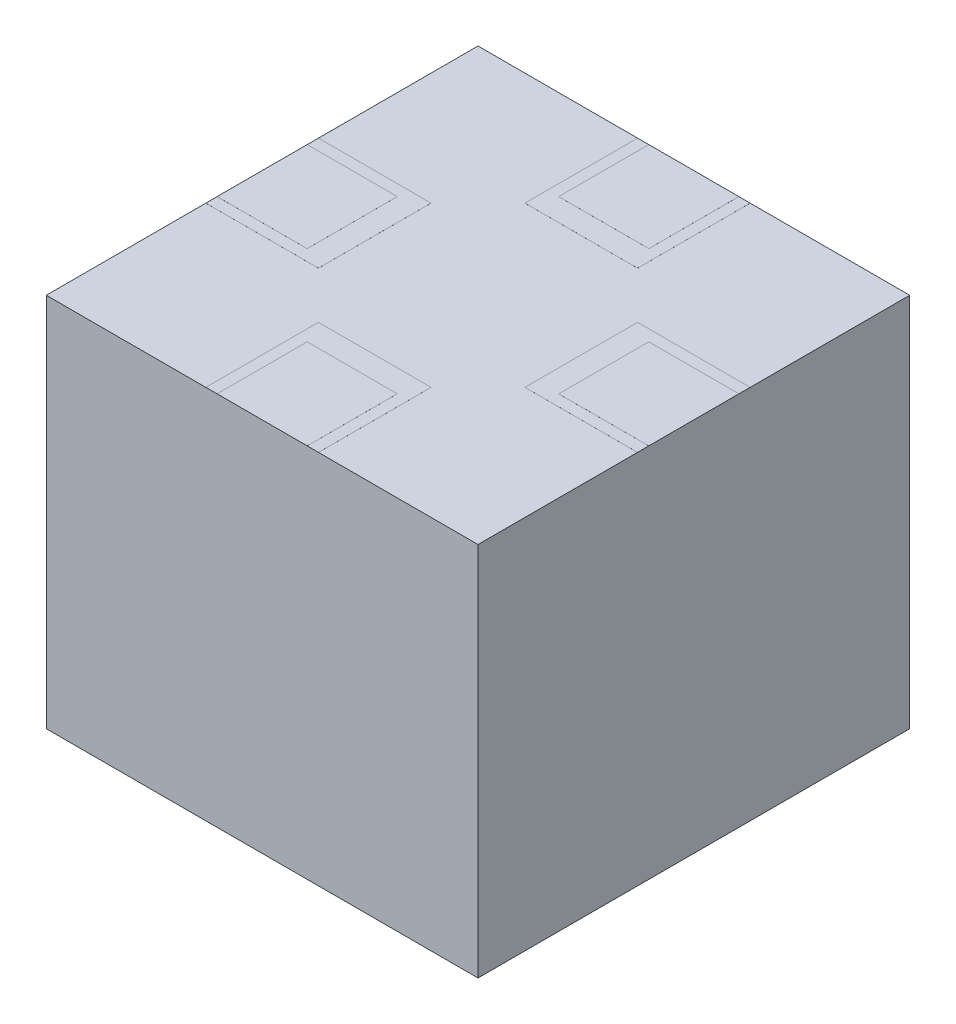
ISO-10303-21;
HEADER;
FILE_DESCRIPTION(('STEP AP214'),'2;1');
FILE_NAME('part.step','',(''),(''),'','','');
FILE_SCHEMA(('AUTOMOTIVE_DESIGN { 1 0 10303 214 1 1 1 1 }'));
ENDSEC;
DATA;
#1=APPLICATION_CONTEXT('core data for automotive mechanical design processes');
#2=APPLICATION_PROTOCOL_DEFINITION('international standard','automotive_design',2000,#1);
#3=PRODUCT_CONTEXT('',#1,'mechanical');
#4=PRODUCT('Part','Part','',(#3));
#5=PRODUCT_RELATED_PRODUCT_CATEGORY('part','',(#4));
#6=PRODUCT_DEFINITION_FORMATION('','',#4);
#7=PRODUCT_DEFINITION_CONTEXT('part definition',#1,'design');
#8=PRODUCT_DEFINITION('design','',#6,#7);
#9=PRODUCT_DEFINITION_SHAPE('','',#8);
#10=(LENGTH_UNIT() NAMED_UNIT(*) SI_UNIT(.MILLI.,.METRE.));
#11=(NAMED_UNIT(*) PLANE_ANGLE_UNIT() SI_UNIT($,.RADIAN.));
#12=(NAMED_UNIT(*) SI_UNIT($,.STERADIAN.) SOLID_ANGLE_UNIT());
#13=UNCERTAINTY_MEASURE_WITH_UNIT(LENGTH_MEASURE(1.E-05),#10,'distance_accuracy_value','');
#14=(GEOMETRIC_REPRESENTATION_CONTEXT(3) GLOBAL_UNCERTAINTY_ASSIGNED_CONTEXT((#13)) GLOBAL_UNIT_ASSIGNED_CONTEXT((#10,
#11,#12)) REPRESENTATION_CONTEXT('',''));
#15=CARTESIAN_POINT('',(0.,0.,0.));
#16=DIRECTION('',(0.,0.,1.));
#17=DIRECTION('',(1.,0.,0.));
#18=AXIS2_PLACEMENT_3D('',#15,#16,#17);
#19=CARTESIAN_POINT('',(0.,200.,0.));
#20=DIRECTION('',(0.,-1.,0.));
#21=DIRECTION('',(0.,0.,-1.));
#22=AXIS2_PLACEMENT_3D('',#19,#20,#21);
#23=PLANE('',#22);
#24=DIRECTION('',(-1.,0.,0.));
#25=VECTOR('',#24,1.);
#26=CARTESIAN_POINT('',(-115.,200.,-30.));
#27=LINE('',#26,#25);
#28=CARTESIAN_POINT('',(-55.,200.,-30.));
#29=VERTEX_POINT('',#28);
#30=CARTESIAN_POINT('',(-115.,200.,-30.));
#31=VERTEX_POINT('',#30);
#32=EDGE_CURVE('E383',#29,#31,#27,.T.);
#33=ORIENTED_EDGE('',*,*,#32,.F.);
#34=DIRECTION('',(0.,0.,-1.));
#35=VECTOR('',#34,1.);
#36=CARTESIAN_POINT('',(-55.,200.,29.9999999999999));
#37=LINE('',#36,#35);
#38=CARTESIAN_POINT('',(-55.,200.,29.9999999999999));
#39=VERTEX_POINT('',#38);
#40=EDGE_CURVE('E387',#39,#29,#37,.T.);
#41=ORIENTED_EDGE('',*,*,#40,.F.);
#42=DIRECTION('',(1.,0.,0.));
#43=VECTOR('',#42,1.);
#44=CARTESIAN_POINT('',(-115.,200.,30.));
#45=LINE('',#44,#43);
#46=CARTESIAN_POINT('',(-115.,200.,30.));
#47=VERTEX_POINT('',#46);
#48=EDGE_CURVE('E397',#47,#39,#45,.T.);
#49=ORIENTED_EDGE('',*,*,#48,.F.);
#50=DIRECTION('',(0.,0.,1.));
#51=VECTOR('',#50,1.);
#52=CARTESIAN_POINT('',(-115.,200.,115.));
#53=LINE('',#52,#51);
#54=CARTESIAN_POINT('',(-115.,200.,115.));
#55=VERTEX_POINT('',#54);
#56=EDGE_CURVE('E513',#47,#55,#53,.T.);
#57=ORIENTED_EDGE('',*,*,#56,.T.);
#58=DIRECTION('',(1.,0.,0.));
#59=VECTOR('',#58,1.);
#60=CARTESIAN_POINT('',(-115.,200.,115.));
#61=LINE('',#60,#59);
#62=CARTESIAN_POINT('',(-30.,200.,115.));
#63=VERTEX_POINT('',#62);
#64=EDGE_CURVE('E517',#55,#63,#61,.T.);
#65=ORIENTED_EDGE('',*,*,#64,.T.);
#66=DIRECTION('',(0.,0.,1.));
#67=VECTOR('',#66,1.);
#68=CARTESIAN_POINT('',(-30.,200.,115.));
#69=LINE('',#68,#67);
#70=CARTESIAN_POINT('',(-30.,200.,55.));
#71=VERTEX_POINT('',#70);
#72=EDGE_CURVE('E413',#71,#63,#69,.T.);
#73=ORIENTED_EDGE('',*,*,#72,.F.);
#74=DIRECTION('',(-1.,0.,0.));
#75=VECTOR('',#74,1.);
#76=CARTESIAN_POINT('',(29.9999999999999,200.,55.));
#77=LINE('',#76,#75);
#78=CARTESIAN_POINT('',(29.9999999999999,200.,55.));
#79=VERTEX_POINT('',#78);
#80=EDGE_CURVE('E418',#79,#71,#77,.T.);
#81=ORIENTED_EDGE('',*,*,#80,.F.);
#82=DIRECTION('',(0.,0.,-1.));
#83=VECTOR('',#82,1.);
#84=CARTESIAN_POINT('',(29.9999999999999,200.,115.));
#85=LINE('',#84,#83);
#86=CARTESIAN_POINT('',(29.9999999999999,200.,115.));
#87=VERTEX_POINT('',#86);
#88=EDGE_CURVE('E428',#87,#79,#85,.T.);
#89=ORIENTED_EDGE('',*,*,#88,.F.);
#90=CARTESIAN_POINT('',(115.,200.,115.));
#91=VERTEX_POINT('',#90);
#92=EDGE_CURVE('E516',#87,#91,#61,.T.);
#93=ORIENTED_EDGE('',*,*,#92,.T.);
#94=DIRECTION('',(0.,0.,-1.));
#95=VECTOR('',#94,1.);
#96=CARTESIAN_POINT('',(115.,200.,115.));
#97=LINE('',#96,#95);
#98=CARTESIAN_POINT('',(115.,200.,30.));
#99=VERTEX_POINT('',#98);
#100=EDGE_CURVE('E507',#91,#99,#97,.T.);
#101=ORIENTED_EDGE('',*,*,#100,.T.);
#102=DIRECTION('',(1.,0.,0.));
#103=VECTOR('',#102,1.);
#104=CARTESIAN_POINT('',(115.,200.,30.));
#105=LINE('',#104,#103);
#106=CARTESIAN_POINT('',(55.,200.,30.));
#107=VERTEX_POINT('',#106);
#108=EDGE_CURVE('E444',#107,#99,#105,.T.);
#109=ORIENTED_EDGE('',*,*,#108,.F.);
#110=DIRECTION('',(0.,0.,1.));
#111=VECTOR('',#110,1.);
#112=CARTESIAN_POINT('',(55.,200.,-29.9999999999999));
#113=LINE('',#112,#111);
#114=CARTESIAN_POINT('',(55.,200.,-29.9999999999999));
#115=VERTEX_POINT('',#114);
#116=EDGE_CURVE('E449',#115,#107,#113,.T.);
#117=ORIENTED_EDGE('',*,*,#116,.F.);
#118=DIRECTION('',(-1.,0.,0.));
#119=VECTOR('',#118,1.);
#120=CARTESIAN_POINT('',(115.,200.,-30.));
#121=LINE('',#120,#119);
#122=CARTESIAN_POINT('',(115.,200.,-30.));
#123=VERTEX_POINT('',#122);
#124=EDGE_CURVE('E459',#123,#115,#121,.T.);
#125=ORIENTED_EDGE('',*,*,#124,.F.);
#126=CARTESIAN_POINT('',(115.,200.,-115.));
#127=VERTEX_POINT('',#126);
#128=EDGE_CURVE('E510',#123,#127,#97,.T.);
#129=ORIENTED_EDGE('',*,*,#128,.T.);
#130=DIRECTION('',(-1.,0.,0.));
#131=VECTOR('',#130,1.);
#132=CARTESIAN_POINT('',(-115.,200.,-115.));
#133=LINE('',#132,#131);
#134=CARTESIAN_POINT('',(30.,200.,-115.));
#135=VERTEX_POINT('',#134);
#136=EDGE_CURVE('E511',#127,#135,#133,.T.);
#137=ORIENTED_EDGE('',*,*,#136,.T.);
#138=DIRECTION('',(0.,0.,-1.));
#139=VECTOR('',#138,1.);
#140=CARTESIAN_POINT('',(30.,200.,-115.));
#141=LINE('',#140,#139);
#142=CARTESIAN_POINT('',(30.,200.,-55.));
#143=VERTEX_POINT('',#142);
#144=EDGE_CURVE('E475',#143,#135,#141,.T.);
#145=ORIENTED_EDGE('',*,*,#144,.F.);
#146=DIRECTION('',(1.,0.,0.));
#147=VECTOR('',#146,1.);
#148=CARTESIAN_POINT('',(-30.,200.,-55.));
#149=LINE('',#148,#147);
#150=CARTESIAN_POINT('',(-30.,200.,-55.));
#151=VERTEX_POINT('',#150);
#152=EDGE_CURVE('E480',#151,#143,#149,.T.);
#153=ORIENTED_EDGE('',*,*,#152,.F.);
#154=DIRECTION('',(0.,0.,1.));
#155=VECTOR('',#154,1.);
#156=CARTESIAN_POINT('',(-30.,200.,-115.));
#157=LINE('',#156,#155);
#158=CARTESIAN_POINT('',(-30.,200.,-115.));
#159=VERTEX_POINT('',#158);
#160=EDGE_CURVE('E490',#159,#151,#157,.T.);
#161=ORIENTED_EDGE('',*,*,#160,.F.);
#162=CARTESIAN_POINT('',(-115.,200.,-115.));
#163=VERTEX_POINT('',#162);
#164=EDGE_CURVE('E509',#159,#163,#133,.T.);
#165=ORIENTED_EDGE('',*,*,#164,.T.);
#166=EDGE_CURVE('E514',#163,#31,#53,.T.);
#167=ORIENTED_EDGE('',*,*,#166,.T.);
#168=EDGE_LOOP('',(#33,#41,#49,#57,#65,#73,#81,#89,#93,#101,#109,#117,#125,#129,#137,#145,#153,
#161,#165,#167));
#169=FACE_BOUND('',#168,.T.);
#170=ADVANCED_FACE('F33',(#169),#23,.F.);
#171=CARTESIAN_POINT('',(115.,200.,115.));
#172=DIRECTION('',(-1.,0.,0.));
#173=DIRECTION('',(0.,0.,1.));
#174=AXIS2_PLACEMENT_3D('',#171,#172,#173);
#175=PLANE('',#174);
#176=DIRECTION('',(0.,0.,-1.));
#177=VECTOR('',#176,1.);
#178=CARTESIAN_POINT('',(115.,0.,115.));
#179=LINE('',#178,#177);
#180=CARTESIAN_POINT('',(115.,0.,115.));
#181=VERTEX_POINT('',#180);
#182=CARTESIAN_POINT('',(115.,0.,-115.));
#183=VERTEX_POINT('',#182);
#184=EDGE_CURVE('E506',#181,#183,#179,.T.);
#185=ORIENTED_EDGE('',*,*,#184,.T.);
#186=DIRECTION('',(0.,-1.,0.));
#187=VECTOR('',#186,1.);
#188=CARTESIAN_POINT('',(115.,200.,-115.));
#189=LINE('',#188,#187);
#190=EDGE_CURVE('E11',#127,#183,#189,.T.);
#191=ORIENTED_EDGE('',*,*,#190,.F.);
#192=ORIENTED_EDGE('',*,*,#128,.F.);
#193=DIRECTION('',(0.,-1.,0.));
#194=VECTOR('',#193,1.);
#195=CARTESIAN_POINT('',(115.,200.01,-30.));
#196=LINE('',#195,#194);
#197=CARTESIAN_POINT('',(115.,200.01,-30.));
#198=VERTEX_POINT('',#197);
#199=EDGE_CURVE('E469',#198,#123,#196,.T.);
#200=ORIENTED_EDGE('',*,*,#199,.F.);
#201=DIRECTION('',(0.,0.,-1.));
#202=VECTOR('',#201,1.);
#203=CARTESIAN_POINT('',(115.,200.01,-30.));
#204=LINE('',#203,#202);
#205=CARTESIAN_POINT('',(115.,200.01,-24.0000000000104));
#206=VERTEX_POINT('',#205);
#207=EDGE_CURVE('E448',#206,#198,#204,.T.);
#208=ORIENTED_EDGE('',*,*,#207,.F.);
#209=DIRECTION('',(0.,-1.,0.));
#210=VECTOR('',#209,1.);
#211=CARTESIAN_POINT('',(115.000000000005,200.02,-24.0000000000104));
#212=LINE('',#211,#210);
#213=CARTESIAN_POINT('',(115.000000000005,200.02,-24.0000000000104));
#214=VERTEX_POINT('',#213);
#215=EDGE_CURVE('E350',#214,#206,#212,.T.);
#216=ORIENTED_EDGE('',*,*,#215,.F.);
#217=DIRECTION('',(0.,0.,-1.));
#218=VECTOR('',#217,1.);
#219=CARTESIAN_POINT('',(115.000000000005,200.02,-24.0000000000104));
#220=LINE('',#219,#218);
#221=CARTESIAN_POINT('',(115.000000000005,200.02,23.9999999999896));
#222=VERTEX_POINT('',#221);
#223=EDGE_CURVE('E324',#222,#214,#220,.T.);
#224=ORIENTED_EDGE('',*,*,#223,.F.);
#225=DIRECTION('',(0.,-1.,0.));
#226=VECTOR('',#225,1.);
#227=CARTESIAN_POINT('',(115.000000000005,200.02,23.9999999999896));
#228=LINE('',#227,#226);
#229=CARTESIAN_POINT('',(115.,200.01,23.9999999999896));
#230=VERTEX_POINT('',#229);
#231=EDGE_CURVE('E334',#222,#230,#228,.T.);
#232=ORIENTED_EDGE('',*,*,#231,.T.);
#233=CARTESIAN_POINT('',(115.,200.01,30.));
#234=VERTEX_POINT('',#233);
#235=EDGE_CURVE('E450',#234,#230,#204,.T.);
#236=ORIENTED_EDGE('',*,*,#235,.F.);
#237=DIRECTION('',(0.,-1.,0.));
#238=VECTOR('',#237,1.);
#239=CARTESIAN_POINT('',(115.,200.01,30.));
#240=LINE('',#239,#238);
#241=EDGE_CURVE('E472',#234,#99,#240,.T.);
#242=ORIENTED_EDGE('',*,*,#241,.T.);
#243=ORIENTED_EDGE('',*,*,#100,.F.);
#244=DIRECTION('',(0.,-1.,0.));
#245=VECTOR('',#244,1.);
#246=CARTESIAN_POINT('',(115.,200.,115.));
#247=LINE('',#246,#245);
#248=EDGE_CURVE('E519',#91,#181,#247,.T.);
#249=ORIENTED_EDGE('',*,*,#248,.T.);
#250=EDGE_LOOP('',(#185,#191,#192,#200,#208,#216,#224,#232,#236,#242,#243,#249));
#251=FACE_BOUND('',#250,.T.);
#252=ADVANCED_FACE('F35',(#251),#175,.F.);
#253=CARTESIAN_POINT('',(-115.,200.,-115.));
#254=DIRECTION('',(0.,0.,1.));
#255=DIRECTION('',(1.,0.,0.));
#256=AXIS2_PLACEMENT_3D('',#253,#254,#255);
#257=PLANE('',#256);
#258=DIRECTION('',(-1.,0.,0.));
#259=VECTOR('',#258,1.);
#260=CARTESIAN_POINT('',(-115.,0.,-115.));
#261=LINE('',#260,#259);
#262=CARTESIAN_POINT('',(-115.,0.,-115.));
#263=VERTEX_POINT('',#262);
#264=EDGE_CURVE('E522',#183,#263,#261,.T.);
#265=ORIENTED_EDGE('',*,*,#264,.T.);
#266=DIRECTION('',(0.,-1.,0.));
#267=VECTOR('',#266,1.);
#268=CARTESIAN_POINT('',(-115.,200.,-115.));
#269=LINE('',#268,#267);
#270=EDGE_CURVE('E41',#163,#263,#269,.T.);
#271=ORIENTED_EDGE('',*,*,#270,.F.);
#272=ORIENTED_EDGE('',*,*,#164,.F.);
#273=DIRECTION('',(0.,-1.,0.));
#274=VECTOR('',#273,1.);
#275=CARTESIAN_POINT('',(-30.,200.01,-115.));
#276=LINE('',#275,#274);
#277=CARTESIAN_POINT('',(-30.,200.01,-115.));
#278=VERTEX_POINT('',#277);
#279=EDGE_CURVE('E500',#278,#159,#276,.T.);
#280=ORIENTED_EDGE('',*,*,#279,.F.);
#281=DIRECTION('',(-1.,0.,0.));
#282=VECTOR('',#281,1.);
#283=CARTESIAN_POINT('',(-30.,200.01,-115.));
#284=LINE('',#283,#282);
#285=CARTESIAN_POINT('',(-24.,200.01,-115.));
#286=VERTEX_POINT('',#285);
#287=EDGE_CURVE('E479',#286,#278,#284,.T.);
#288=ORIENTED_EDGE('',*,*,#287,.F.);
#289=DIRECTION('',(0.,-1.,0.));
#290=VECTOR('',#289,1.);
#291=CARTESIAN_POINT('',(-24.,200.02,-115.));
#292=LINE('',#291,#290);
#293=CARTESIAN_POINT('',(-24.,200.02,-115.));
#294=VERTEX_POINT('',#293);
#295=EDGE_CURVE('E380',#294,#286,#292,.T.);
#296=ORIENTED_EDGE('',*,*,#295,.F.);
#297=DIRECTION('',(-1.,0.,0.));
#298=VECTOR('',#297,1.);
#299=CARTESIAN_POINT('',(-24.,200.02,-115.));
#300=LINE('',#299,#298);
#301=CARTESIAN_POINT('',(24.,200.02,-115.));
#302=VERTEX_POINT('',#301);
#303=EDGE_CURVE('E354',#302,#294,#300,.T.);
#304=ORIENTED_EDGE('',*,*,#303,.F.);
#305=DIRECTION('',(0.,-1.,0.));
#306=VECTOR('',#305,1.);
#307=CARTESIAN_POINT('',(24.,200.02,-115.));
#308=LINE('',#307,#306);
#309=CARTESIAN_POINT('',(24.,200.01,-115.));
#310=VERTEX_POINT('',#309);
#311=EDGE_CURVE('E364',#302,#310,#308,.T.);
#312=ORIENTED_EDGE('',*,*,#311,.T.);
#313=CARTESIAN_POINT('',(30.,200.01,-115.));
#314=VERTEX_POINT('',#313);
#315=EDGE_CURVE('E481',#314,#310,#284,.T.);
#316=ORIENTED_EDGE('',*,*,#315,.F.);
#317=DIRECTION('',(0.,-1.,0.));
#318=VECTOR('',#317,1.);
#319=CARTESIAN_POINT('',(30.,200.01,-115.));
#320=LINE('',#319,#318);
#321=EDGE_CURVE('E503',#314,#135,#320,.T.);
#322=ORIENTED_EDGE('',*,*,#321,.T.);
#323=ORIENTED_EDGE('',*,*,#136,.F.);
#324=ORIENTED_EDGE('',*,*,#190,.T.);
#325=EDGE_LOOP('',(#265,#271,#272,#280,#288,#296,#304,#312,#316,#322,#323,#324));
#326=FACE_BOUND('',#325,.T.);
#327=ADVANCED_FACE('F623',(#326),#257,.F.);
#328=CARTESIAN_POINT('',(-115.,200.,115.));
#329=DIRECTION('',(1.,0.,0.));
#330=DIRECTION('',(0.,0.,-1.));
#331=AXIS2_PLACEMENT_3D('',#328,#329,#330);
#332=PLANE('',#331);
#333=DIRECTION('',(0.,0.,1.));
#334=VECTOR('',#333,1.);
#335=CARTESIAN_POINT('',(-115.,0.,115.));
#336=LINE('',#335,#334);
#337=CARTESIAN_POINT('',(-115.,0.,115.));
#338=VERTEX_POINT('',#337);
#339=EDGE_CURVE('E524',#263,#338,#336,.T.);
#340=ORIENTED_EDGE('',*,*,#339,.T.);
#341=DIRECTION('',(0.,-1.,0.));
#342=VECTOR('',#341,1.);
#343=CARTESIAN_POINT('',(-115.,200.,115.));
#344=LINE('',#343,#342);
#345=EDGE_CURVE('E530',#55,#338,#344,.T.);
#346=ORIENTED_EDGE('',*,*,#345,.F.);
#347=ORIENTED_EDGE('',*,*,#56,.F.);
#348=DIRECTION('',(0.,-1.,0.));
#349=VECTOR('',#348,1.);
#350=CARTESIAN_POINT('',(-115.,200.01,30.));
#351=LINE('',#350,#349);
#352=CARTESIAN_POINT('',(-115.,200.01,30.));
#353=VERTEX_POINT('',#352);
#354=EDGE_CURVE('E407',#353,#47,#351,.T.);
#355=ORIENTED_EDGE('',*,*,#354,.F.);
#356=DIRECTION('',(0.,0.,1.));
#357=VECTOR('',#356,1.);
#358=CARTESIAN_POINT('',(-115.,200.01,30.));
#359=LINE('',#358,#357);
#360=CARTESIAN_POINT('',(-115.,200.01,24.0000000000049));
#361=VERTEX_POINT('',#360);
#362=EDGE_CURVE('E287',#361,#353,#359,.T.);
#363=ORIENTED_EDGE('',*,*,#362,.F.);
#364=DIRECTION('',(0.,-1.,0.));
#365=VECTOR('',#364,1.);
#366=CARTESIAN_POINT('',(-114.99999999999,200.02,24.0000000000049));
#367=LINE('',#366,#365);
#368=CARTESIAN_POINT('',(-114.99999999999,200.02,24.0000000000049));
#369=VERTEX_POINT('',#368);
#370=EDGE_CURVE('E269',#369,#361,#367,.T.);
#371=ORIENTED_EDGE('',*,*,#370,.F.);
#372=DIRECTION('',(0.,0.,1.));
#373=VECTOR('',#372,1.);
#374=CARTESIAN_POINT('',(-114.99999999999,200.02,24.0000000000049));
#375=LINE('',#374,#373);
#376=CARTESIAN_POINT('',(-114.99999999999,200.02,-23.9999999999951));
#377=VERTEX_POINT('',#376);
#378=EDGE_CURVE('E275',#377,#369,#375,.T.);
#379=ORIENTED_EDGE('',*,*,#378,.F.);
#380=DIRECTION('',(0.,-1.,0.));
#381=VECTOR('',#380,1.);
#382=CARTESIAN_POINT('',(-114.99999999999,200.02,-23.9999999999951));
#383=LINE('',#382,#381);
#384=CARTESIAN_POINT('',(-115.,200.01,-23.9999999999951));
#385=VERTEX_POINT('',#384);
#386=EDGE_CURVE('E596',#377,#385,#383,.T.);
#387=ORIENTED_EDGE('',*,*,#386,.T.);
#388=CARTESIAN_POINT('',(-115.,200.01,-30.));
#389=VERTEX_POINT('',#388);
#390=EDGE_CURVE('E388',#389,#385,#359,.T.);
#391=ORIENTED_EDGE('',*,*,#390,.F.);
#392=DIRECTION('',(0.,-1.,0.));
#393=VECTOR('',#392,1.);
#394=CARTESIAN_POINT('',(-115.,200.01,-30.));
#395=LINE('',#394,#393);
#396=EDGE_CURVE('E410',#389,#31,#395,.T.);
#397=ORIENTED_EDGE('',*,*,#396,.T.);
#398=ORIENTED_EDGE('',*,*,#166,.F.);
#399=ORIENTED_EDGE('',*,*,#270,.T.);
#400=EDGE_LOOP('',(#340,#346,#347,#355,#363,#371,#379,#387,#391,#397,#398,#399));
#401=FACE_BOUND('',#400,.T.);
#402=ADVANCED_FACE('F285',(#401),#332,.F.);
#403=CARTESIAN_POINT('',(-115.,200.,115.));
#404=DIRECTION('',(0.,0.,-1.));
#405=DIRECTION('',(-1.,0.,0.));
#406=AXIS2_PLACEMENT_3D('',#403,#404,#405);
#407=PLANE('',#406);
#408=DIRECTION('',(1.,0.,0.));
#409=VECTOR('',#408,1.);
#410=CARTESIAN_POINT('',(-115.,0.,115.));
#411=LINE('',#410,#409);
#412=EDGE_CURVE('E526',#338,#181,#411,.T.);
#413=ORIENTED_EDGE('',*,*,#412,.T.);
#414=ORIENTED_EDGE('',*,*,#248,.F.);
#415=ORIENTED_EDGE('',*,*,#92,.F.);
#416=DIRECTION('',(0.,-1.,0.));
#417=VECTOR('',#416,1.);
#418=CARTESIAN_POINT('',(29.9999999999999,200.01,115.));
#419=LINE('',#418,#417);
#420=CARTESIAN_POINT('',(29.9999999999999,200.01,115.));
#421=VERTEX_POINT('',#420);
#422=EDGE_CURVE('E438',#421,#87,#419,.T.);
#423=ORIENTED_EDGE('',*,*,#422,.F.);
#424=DIRECTION('',(1.,0.,0.));
#425=VECTOR('',#424,1.);
#426=CARTESIAN_POINT('',(29.9999999999999,200.01,115.));
#427=LINE('',#426,#425);
#428=CARTESIAN_POINT('',(24.0000000000152,200.01,115.));
#429=VERTEX_POINT('',#428);
#430=EDGE_CURVE('E417',#429,#421,#427,.T.);
#431=ORIENTED_EDGE('',*,*,#430,.F.);
#432=DIRECTION('',(0.,-1.,0.));
#433=VECTOR('',#432,1.);
#434=CARTESIAN_POINT('',(24.0000000000153,200.02,114.999999999995));
#435=LINE('',#434,#433);
#436=CARTESIAN_POINT('',(24.0000000000153,200.02,114.999999999995));
#437=VERTEX_POINT('',#436);
#438=EDGE_CURVE('E320',#437,#429,#435,.T.);
#439=ORIENTED_EDGE('',*,*,#438,.F.);
#440=DIRECTION('',(1.,0.,0.));
#441=VECTOR('',#440,1.);
#442=CARTESIAN_POINT('',(24.0000000000153,200.02,114.999999999995));
#443=LINE('',#442,#441);
#444=CARTESIAN_POINT('',(-23.9999999999847,200.02,114.999999999995));
#445=VERTEX_POINT('',#444);
#446=EDGE_CURVE('E297',#445,#437,#443,.T.);
#447=ORIENTED_EDGE('',*,*,#446,.F.);
#448=DIRECTION('',(0.,-1.,0.));
#449=VECTOR('',#448,1.);
#450=CARTESIAN_POINT('',(-23.9999999999847,200.02,114.999999999995));
#451=LINE('',#450,#449);
#452=CARTESIAN_POINT('',(-23.9999999999847,200.01,115.));
#453=VERTEX_POINT('',#452);
#454=EDGE_CURVE('E306',#445,#453,#451,.T.);
#455=ORIENTED_EDGE('',*,*,#454,.T.);
#456=CARTESIAN_POINT('',(-30.,200.01,115.));
#457=VERTEX_POINT('',#456);
#458=EDGE_CURVE('E419',#457,#453,#427,.T.);
#459=ORIENTED_EDGE('',*,*,#458,.F.);
#460=DIRECTION('',(0.,-1.,0.));
#461=VECTOR('',#460,1.);
#462=CARTESIAN_POINT('',(-30.,200.01,115.));
#463=LINE('',#462,#461);
#464=EDGE_CURVE('E441',#457,#63,#463,.T.);
#465=ORIENTED_EDGE('',*,*,#464,.T.);
#466=ORIENTED_EDGE('',*,*,#64,.F.);
#467=ORIENTED_EDGE('',*,*,#345,.T.);
#468=EDGE_LOOP('',(#413,#414,#415,#423,#431,#439,#447,#455,#459,#465,#466,#467));
#469=FACE_BOUND('',#468,.T.);
#470=ADVANCED_FACE('F545',(#469),#407,.F.);
#471=CARTESIAN_POINT('',(0.,0.,0.));
#472=DIRECTION('',(0.,-1.,0.));
#473=DIRECTION('',(0.,0.,-1.));
#474=AXIS2_PLACEMENT_3D('',#471,#472,#473);
#475=PLANE('',#474);
#476=ORIENTED_EDGE('',*,*,#184,.F.);
#477=ORIENTED_EDGE('',*,*,#412,.F.);
#478=ORIENTED_EDGE('',*,*,#339,.F.);
#479=ORIENTED_EDGE('',*,*,#264,.F.);
#480=EDGE_LOOP('',(#476,#477,#478,#479));
#481=FACE_BOUND('',#480,.T.);
#482=ADVANCED_FACE('F542',(#481),#475,.T.);
#483=CARTESIAN_POINT('',(30.,200.01,-115.));
#484=DIRECTION('',(-1.,0.,0.));
#485=DIRECTION('',(0.,0.,1.));
#486=AXIS2_PLACEMENT_3D('',#483,#484,#485);
#487=PLANE('',#486);
#488=ORIENTED_EDGE('',*,*,#144,.T.);
#489=ORIENTED_EDGE('',*,*,#321,.F.);
#490=DIRECTION('',(0.,0.,-1.));
#491=VECTOR('',#490,1.);
#492=CARTESIAN_POINT('',(30.,200.01,-115.));
#493=LINE('',#492,#491);
#494=CARTESIAN_POINT('',(30.,200.01,-55.));
#495=VERTEX_POINT('',#494);
#496=EDGE_CURVE('E476',#495,#314,#493,.T.);
#497=ORIENTED_EDGE('',*,*,#496,.F.);
#498=DIRECTION('',(0.,-1.,0.));
#499=VECTOR('',#498,1.);
#500=CARTESIAN_POINT('',(30.,200.01,-55.));
#501=LINE('',#500,#499);
#502=EDGE_CURVE('E487',#495,#143,#501,.T.);
#503=ORIENTED_EDGE('',*,*,#502,.T.);
#504=EDGE_LOOP('',(#488,#489,#497,#503));
#505=FACE_BOUND('',#504,.T.);
#506=ADVANCED_FACE('F626',(#505),#487,.F.);
#507=CARTESIAN_POINT('',(-30.,200.01,-115.));
#508=DIRECTION('',(1.,0.,0.));
#509=DIRECTION('',(0.,0.,-1.));
#510=AXIS2_PLACEMENT_3D('',#507,#508,#509);
#511=PLANE('',#510);
#512=ORIENTED_EDGE('',*,*,#160,.T.);
#513=DIRECTION('',(0.,-1.,0.));
#514=VECTOR('',#513,1.);
#515=CARTESIAN_POINT('',(-30.,200.01,-55.));
#516=LINE('',#515,#514);
#517=CARTESIAN_POINT('',(-30.,200.01,-55.));
#518=VERTEX_POINT('',#517);
#519=EDGE_CURVE('E497',#518,#151,#516,.T.);
#520=ORIENTED_EDGE('',*,*,#519,.F.);
#521=DIRECTION('',(0.,0.,1.));
#522=VECTOR('',#521,1.);
#523=CARTESIAN_POINT('',(-30.,200.01,-115.));
#524=LINE('',#523,#522);
#525=EDGE_CURVE('E483',#278,#518,#524,.T.);
#526=ORIENTED_EDGE('',*,*,#525,.F.);
#527=ORIENTED_EDGE('',*,*,#279,.T.);
#528=EDGE_LOOP('',(#512,#520,#526,#527));
#529=FACE_BOUND('',#528,.T.);
#530=ADVANCED_FACE('F725',(#529),#511,.F.);
#531=CARTESIAN_POINT('',(-30.,200.01,-55.));
#532=DIRECTION('',(0.,0.,-1.));
#533=DIRECTION('',(-1.,0.,0.));
#534=AXIS2_PLACEMENT_3D('',#531,#532,#533);
#535=PLANE('',#534);
#536=ORIENTED_EDGE('',*,*,#152,.T.);
#537=ORIENTED_EDGE('',*,*,#502,.F.);
#538=DIRECTION('',(1.,0.,0.));
#539=VECTOR('',#538,1.);
#540=CARTESIAN_POINT('',(-30.,200.01,-55.));
#541=LINE('',#540,#539);
#542=EDGE_CURVE('E485',#518,#495,#541,.T.);
#543=ORIENTED_EDGE('',*,*,#542,.F.);
#544=ORIENTED_EDGE('',*,*,#519,.T.);
#545=EDGE_LOOP('',(#536,#537,#543,#544));
#546=FACE_BOUND('',#545,.T.);
#547=ADVANCED_FACE('F722',(#546),#535,.F.);
#548=CARTESIAN_POINT('',(0.,200.01,0.));
#549=DIRECTION('',(0.,1.,0.));
#550=DIRECTION('',(0.,0.,1.));
#551=AXIS2_PLACEMENT_3D('',#548,#549,#550);
#552=PLANE('',#551);
#553=DIRECTION('',(0.,0.,-1.));
#554=VECTOR('',#553,1.);
#555=CARTESIAN_POINT('',(24.,200.01,-67.));
#556=LINE('',#555,#554);
#557=CARTESIAN_POINT('',(24.,200.01,-67.));
#558=VERTEX_POINT('',#557);
#559=EDGE_CURVE('E358',#558,#310,#556,.T.);
#560=ORIENTED_EDGE('',*,*,#559,.F.);
#561=DIRECTION('',(1.,0.,0.));
#562=VECTOR('',#561,1.);
#563=CARTESIAN_POINT('',(-24.,200.01,-67.));
#564=LINE('',#563,#562);
#565=CARTESIAN_POINT('',(-24.,200.01,-67.));
#566=VERTEX_POINT('',#565);
#567=EDGE_CURVE('E367',#566,#558,#564,.T.);
#568=ORIENTED_EDGE('',*,*,#567,.F.);
#569=DIRECTION('',(0.,0.,1.));
#570=VECTOR('',#569,1.);
#571=CARTESIAN_POINT('',(-24.,200.01,-115.));
#572=LINE('',#571,#570);
#573=EDGE_CURVE('E353',#286,#566,#572,.T.);
#574=ORIENTED_EDGE('',*,*,#573,.F.);
#575=ORIENTED_EDGE('',*,*,#287,.T.);
#576=ORIENTED_EDGE('',*,*,#525,.T.);
#577=ORIENTED_EDGE('',*,*,#542,.T.);
#578=ORIENTED_EDGE('',*,*,#496,.T.);
#579=ORIENTED_EDGE('',*,*,#315,.T.);
#580=EDGE_LOOP('',(#560,#568,#574,#575,#576,#577,#578,#579));
#581=FACE_BOUND('',#580,.T.);
#582=ADVANCED_FACE('F718',(#581),#552,.T.);
#583=CARTESIAN_POINT('',(115.,200.01,30.));
#584=DIRECTION('',(0.,0.,-1.));
#585=DIRECTION('',(-1.,0.,0.));
#586=AXIS2_PLACEMENT_3D('',#583,#584,#585);
#587=PLANE('',#586);
#588=ORIENTED_EDGE('',*,*,#108,.T.);
#589=ORIENTED_EDGE('',*,*,#241,.F.);
#590=DIRECTION('',(1.,0.,0.));
#591=VECTOR('',#590,1.);
#592=CARTESIAN_POINT('',(115.,200.01,30.));
#593=LINE('',#592,#591);
#594=CARTESIAN_POINT('',(55.,200.01,30.));
#595=VERTEX_POINT('',#594);
#596=EDGE_CURVE('E445',#595,#234,#593,.T.);
#597=ORIENTED_EDGE('',*,*,#596,.F.);
#598=DIRECTION('',(0.,-1.,0.));
#599=VECTOR('',#598,1.);
#600=CARTESIAN_POINT('',(55.,200.01,30.));
#601=LINE('',#600,#599);
#602=EDGE_CURVE('E456',#595,#107,#601,.T.);
#603=ORIENTED_EDGE('',*,*,#602,.T.);
#604=EDGE_LOOP('',(#588,#589,#597,#603));
#605=FACE_BOUND('',#604,.T.);
#606=ADVANCED_FACE('F715',(#605),#587,.F.);
#607=CARTESIAN_POINT('',(115.,200.01,-30.));
#608=DIRECTION('',(0.,0.,1.));
#609=DIRECTION('',(1.,0.,0.));
#610=AXIS2_PLACEMENT_3D('',#607,#608,#609);
#611=PLANE('',#610);
#612=ORIENTED_EDGE('',*,*,#124,.T.);
#613=DIRECTION('',(0.,-1.,0.));
#614=VECTOR('',#613,1.);
#615=CARTESIAN_POINT('',(55.,200.01,-29.9999999999999));
#616=LINE('',#615,#614);
#617=CARTESIAN_POINT('',(55.,200.01,-29.9999999999999));
#618=VERTEX_POINT('',#617);
#619=EDGE_CURVE('E466',#618,#115,#616,.T.);
#620=ORIENTED_EDGE('',*,*,#619,.F.);
#621=DIRECTION('',(-1.,0.,0.));
#622=VECTOR('',#621,1.);
#623=CARTESIAN_POINT('',(115.,200.01,-30.));
#624=LINE('',#623,#622);
#625=EDGE_CURVE('E452',#198,#618,#624,.T.);
#626=ORIENTED_EDGE('',*,*,#625,.F.);
#627=ORIENTED_EDGE('',*,*,#199,.T.);
#628=EDGE_LOOP('',(#612,#620,#626,#627));
#629=FACE_BOUND('',#628,.T.);
#630=ADVANCED_FACE('F643',(#629),#611,.F.);
#631=CARTESIAN_POINT('',(55.,200.01,-29.9999999999999));
#632=DIRECTION('',(1.,0.,0.));
#633=DIRECTION('',(0.,0.,-1.));
#634=AXIS2_PLACEMENT_3D('',#631,#632,#633);
#635=PLANE('',#634);
#636=ORIENTED_EDGE('',*,*,#116,.T.);
#637=ORIENTED_EDGE('',*,*,#602,.F.);
#638=DIRECTION('',(0.,0.,1.));
#639=VECTOR('',#638,1.);
#640=CARTESIAN_POINT('',(55.,200.01,-29.9999999999999));
#641=LINE('',#640,#639);
#642=EDGE_CURVE('E454',#618,#595,#641,.T.);
#643=ORIENTED_EDGE('',*,*,#642,.F.);
#644=ORIENTED_EDGE('',*,*,#619,.T.);
#645=EDGE_LOOP('',(#636,#637,#643,#644));
#646=FACE_BOUND('',#645,.T.);
#647=ADVANCED_FACE('F709',(#646),#635,.F.);
#648=CARTESIAN_POINT('',(0.,200.01,0.));
#649=DIRECTION('',(0.,1.,0.));
#650=DIRECTION('',(0.,0.,1.));
#651=AXIS2_PLACEMENT_3D('',#648,#649,#650);
#652=PLANE('',#651);
#653=DIRECTION('',(1.,0.,0.));
#654=VECTOR('',#653,1.);
#655=CARTESIAN_POINT('',(67.0000000000049,200.01,23.9999999999896));
#656=LINE('',#655,#654);
#657=CARTESIAN_POINT('',(67.0000000000049,200.01,23.9999999999896));
#658=VERTEX_POINT('',#657);
#659=EDGE_CURVE('E328',#658,#230,#656,.T.);
#660=ORIENTED_EDGE('',*,*,#659,.F.);
#661=DIRECTION('',(0.,0.,1.));
#662=VECTOR('',#661,1.);
#663=CARTESIAN_POINT('',(67.0000000000049,200.01,-24.0000000000103));
#664=LINE('',#663,#662);
#665=CARTESIAN_POINT('',(67.0000000000049,200.01,-24.0000000000103));
#666=VERTEX_POINT('',#665);
#667=EDGE_CURVE('E337',#666,#658,#664,.T.);
#668=ORIENTED_EDGE('',*,*,#667,.F.);
#669=DIRECTION('',(-1.,0.,0.));
#670=VECTOR('',#669,1.);
#671=CARTESIAN_POINT('',(115.000000000005,200.01,-24.0000000000104));
#672=LINE('',#671,#670);
#673=EDGE_CURVE('E323',#206,#666,#672,.T.);
#674=ORIENTED_EDGE('',*,*,#673,.F.);
#675=ORIENTED_EDGE('',*,*,#207,.T.);
#676=ORIENTED_EDGE('',*,*,#625,.T.);
#677=ORIENTED_EDGE('',*,*,#642,.T.);
#678=ORIENTED_EDGE('',*,*,#596,.T.);
#679=ORIENTED_EDGE('',*,*,#235,.T.);
#680=EDGE_LOOP('',(#660,#668,#674,#675,#676,#677,#678,#679));
#681=FACE_BOUND('',#680,.T.);
#682=ADVANCED_FACE('F646',(#681),#652,.T.);
#683=CARTESIAN_POINT('',(-30.,200.01,115.));
#684=DIRECTION('',(1.,0.,0.));
#685=DIRECTION('',(0.,0.,-1.));
#686=AXIS2_PLACEMENT_3D('',#683,#684,#685);
#687=PLANE('',#686);
#688=ORIENTED_EDGE('',*,*,#72,.T.);
#689=ORIENTED_EDGE('',*,*,#464,.F.);
#690=DIRECTION('',(0.,0.,1.));
#691=VECTOR('',#690,1.);
#692=CARTESIAN_POINT('',(-30.,200.01,115.));
#693=LINE('',#692,#691);
#694=CARTESIAN_POINT('',(-30.,200.01,55.));
#695=VERTEX_POINT('',#694);
#696=EDGE_CURVE('E414',#695,#457,#693,.T.);
#697=ORIENTED_EDGE('',*,*,#696,.F.);
#698=DIRECTION('',(0.,-1.,0.));
#699=VECTOR('',#698,1.);
#700=CARTESIAN_POINT('',(-30.,200.01,55.));
#701=LINE('',#700,#699);
#702=EDGE_CURVE('E425',#695,#71,#701,.T.);
#703=ORIENTED_EDGE('',*,*,#702,.T.);
#704=EDGE_LOOP('',(#688,#689,#697,#703));
#705=FACE_BOUND('',#704,.T.);
#706=ADVANCED_FACE('F581',(#705),#687,.F.);
#707=CARTESIAN_POINT('',(29.9999999999999,200.01,115.));
#708=DIRECTION('',(-1.,0.,0.));
#709=DIRECTION('',(0.,0.,1.));
#710=AXIS2_PLACEMENT_3D('',#707,#708,#709);
#711=PLANE('',#710);
#712=ORIENTED_EDGE('',*,*,#88,.T.);
#713=DIRECTION('',(0.,-1.,0.));
#714=VECTOR('',#713,1.);
#715=CARTESIAN_POINT('',(29.9999999999999,200.01,55.));
#716=LINE('',#715,#714);
#717=CARTESIAN_POINT('',(29.9999999999999,200.01,55.));
#718=VERTEX_POINT('',#717);
#719=EDGE_CURVE('E435',#718,#79,#716,.T.);
#720=ORIENTED_EDGE('',*,*,#719,.F.);
#721=DIRECTION('',(0.,0.,-1.));
#722=VECTOR('',#721,1.);
#723=CARTESIAN_POINT('',(29.9999999999999,200.01,115.));
#724=LINE('',#723,#722);
#725=EDGE_CURVE('E421',#421,#718,#724,.T.);
#726=ORIENTED_EDGE('',*,*,#725,.F.);
#727=ORIENTED_EDGE('',*,*,#422,.T.);
#728=EDGE_LOOP('',(#712,#720,#726,#727));
#729=FACE_BOUND('',#728,.T.);
#730=ADVANCED_FACE('F559',(#729),#711,.F.);
#731=CARTESIAN_POINT('',(29.9999999999999,200.01,55.));
#732=DIRECTION('',(0.,0.,1.));
#733=DIRECTION('',(1.,0.,0.));
#734=AXIS2_PLACEMENT_3D('',#731,#732,#733);
#735=PLANE('',#734);
#736=ORIENTED_EDGE('',*,*,#80,.T.);
#737=ORIENTED_EDGE('',*,*,#702,.F.);
#738=DIRECTION('',(-1.,0.,0.));
#739=VECTOR('',#738,1.);
#740=CARTESIAN_POINT('',(29.9999999999999,200.01,55.));
#741=LINE('',#740,#739);
#742=EDGE_CURVE('E423',#718,#695,#741,.T.);
#743=ORIENTED_EDGE('',*,*,#742,.F.);
#744=ORIENTED_EDGE('',*,*,#719,.T.);
#745=EDGE_LOOP('',(#736,#737,#743,#744));
#746=FACE_BOUND('',#745,.T.);
#747=ADVANCED_FACE('F699',(#746),#735,.F.);
#748=CARTESIAN_POINT('',(0.,200.01,0.));
#749=DIRECTION('',(0.,1.,0.));
#750=DIRECTION('',(0.,0.,1.));
#751=AXIS2_PLACEMENT_3D('',#748,#749,#750);
#752=PLANE('',#751);
#753=DIRECTION('',(0.,0.,1.));
#754=VECTOR('',#753,1.);
#755=CARTESIAN_POINT('',(-23.9999999999847,200.01,66.9999999999945));
#756=LINE('',#755,#754);
#757=CARTESIAN_POINT('',(-23.9999999999847,200.01,66.9999999999945));
#758=VERTEX_POINT('',#757);
#759=EDGE_CURVE('E301',#758,#453,#756,.T.);
#760=ORIENTED_EDGE('',*,*,#759,.F.);
#761=DIRECTION('',(-1.,0.,0.));
#762=VECTOR('',#761,1.);
#763=CARTESIAN_POINT('',(24.0000000000152,200.01,66.9999999999945));
#764=LINE('',#763,#762);
#765=CARTESIAN_POINT('',(24.0000000000152,200.01,66.9999999999945));
#766=VERTEX_POINT('',#765);
#767=EDGE_CURVE('E291',#766,#758,#764,.T.);
#768=ORIENTED_EDGE('',*,*,#767,.F.);
#769=DIRECTION('',(0.,0.,-1.));
#770=VECTOR('',#769,1.);
#771=CARTESIAN_POINT('',(24.0000000000153,200.01,114.999999999995));
#772=LINE('',#771,#770);
#773=EDGE_CURVE('E288',#429,#766,#772,.T.);
#774=ORIENTED_EDGE('',*,*,#773,.F.);
#775=ORIENTED_EDGE('',*,*,#430,.T.);
#776=ORIENTED_EDGE('',*,*,#725,.T.);
#777=ORIENTED_EDGE('',*,*,#742,.T.);
#778=ORIENTED_EDGE('',*,*,#696,.T.);
#779=ORIENTED_EDGE('',*,*,#458,.T.);
#780=EDGE_LOOP('',(#760,#768,#774,#775,#776,#777,#778,#779));
#781=FACE_BOUND('',#780,.T.);
#782=ADVANCED_FACE('F562',(#781),#752,.T.);
#783=CARTESIAN_POINT('',(-115.,200.01,-30.));
#784=DIRECTION('',(0.,0.,1.));
#785=DIRECTION('',(1.,0.,0.));
#786=AXIS2_PLACEMENT_3D('',#783,#784,#785);
#787=PLANE('',#786);
#788=ORIENTED_EDGE('',*,*,#32,.T.);
#789=ORIENTED_EDGE('',*,*,#396,.F.);
#790=DIRECTION('',(-1.,0.,0.));
#791=VECTOR('',#790,1.);
#792=CARTESIAN_POINT('',(-115.,200.01,-30.));
#793=LINE('',#792,#791);
#794=CARTESIAN_POINT('',(-55.,200.01,-30.));
#795=VERTEX_POINT('',#794);
#796=EDGE_CURVE('E384',#795,#389,#793,.T.);
#797=ORIENTED_EDGE('',*,*,#796,.F.);
#798=DIRECTION('',(0.,-1.,0.));
#799=VECTOR('',#798,1.);
#800=CARTESIAN_POINT('',(-55.,200.01,-30.));
#801=LINE('',#800,#799);
#802=EDGE_CURVE('E394',#795,#29,#801,.T.);
#803=ORIENTED_EDGE('',*,*,#802,.T.);
#804=EDGE_LOOP('',(#788,#789,#797,#803));
#805=FACE_BOUND('',#804,.T.);
#806=ADVANCED_FACE('F595',(#805),#787,.F.);
#807=CARTESIAN_POINT('',(-115.,200.01,30.));
#808=DIRECTION('',(0.,0.,-1.));
#809=DIRECTION('',(-1.,0.,0.));
#810=AXIS2_PLACEMENT_3D('',#807,#808,#809);
#811=PLANE('',#810);
#812=ORIENTED_EDGE('',*,*,#48,.T.);
#813=DIRECTION('',(0.,-1.,0.));
#814=VECTOR('',#813,1.);
#815=CARTESIAN_POINT('',(-55.,200.01,29.9999999999999));
#816=LINE('',#815,#814);
#817=CARTESIAN_POINT('',(-55.,200.01,29.9999999999999));
#818=VERTEX_POINT('',#817);
#819=EDGE_CURVE('E404',#818,#39,#816,.T.);
#820=ORIENTED_EDGE('',*,*,#819,.F.);
#821=DIRECTION('',(1.,0.,0.));
#822=VECTOR('',#821,1.);
#823=CARTESIAN_POINT('',(-115.,200.01,30.));
#824=LINE('',#823,#822);
#825=EDGE_CURVE('E390',#353,#818,#824,.T.);
#826=ORIENTED_EDGE('',*,*,#825,.F.);
#827=ORIENTED_EDGE('',*,*,#354,.T.);
#828=EDGE_LOOP('',(#812,#820,#826,#827));
#829=FACE_BOUND('',#828,.T.);
#830=ADVANCED_FACE('F586',(#829),#811,.F.);
#831=CARTESIAN_POINT('',(-55.,200.01,29.9999999999999));
#832=DIRECTION('',(-1.,0.,0.));
#833=DIRECTION('',(0.,0.,1.));
#834=AXIS2_PLACEMENT_3D('',#831,#832,#833);
#835=PLANE('',#834);
#836=ORIENTED_EDGE('',*,*,#40,.T.);
#837=ORIENTED_EDGE('',*,*,#802,.F.);
#838=DIRECTION('',(0.,0.,-1.));
#839=VECTOR('',#838,1.);
#840=CARTESIAN_POINT('',(-55.,200.01,29.9999999999999));
#841=LINE('',#840,#839);
#842=EDGE_CURVE('E392',#818,#795,#841,.T.);
#843=ORIENTED_EDGE('',*,*,#842,.F.);
#844=ORIENTED_EDGE('',*,*,#819,.T.);
#845=EDGE_LOOP('',(#836,#837,#843,#844));
#846=FACE_BOUND('',#845,.T.);
#847=ADVANCED_FACE('F593',(#846),#835,.F.);
#848=CARTESIAN_POINT('',(0.,200.01,0.));
#849=DIRECTION('',(0.,1.,0.));
#850=DIRECTION('',(0.,0.,1.));
#851=AXIS2_PLACEMENT_3D('',#848,#849,#850);
#852=PLANE('',#851);
#853=DIRECTION('',(-1.,0.,0.));
#854=VECTOR('',#853,1.);
#855=CARTESIAN_POINT('',(-66.9999999999897,200.01,-23.9999999999951));
#856=LINE('',#855,#854);
#857=CARTESIAN_POINT('',(-66.9999999999897,200.01,-23.9999999999951));
#858=VERTEX_POINT('',#857);
#859=EDGE_CURVE('E48',#858,#385,#856,.T.);
#860=ORIENTED_EDGE('',*,*,#859,.F.);
#861=DIRECTION('',(0.,0.,-1.));
#862=VECTOR('',#861,1.);
#863=CARTESIAN_POINT('',(-66.9999999999897,200.01,24.0000000000049));
#864=LINE('',#863,#862);
#865=CARTESIAN_POINT('',(-66.9999999999897,200.01,24.0000000000049));
#866=VERTEX_POINT('',#865);
#867=EDGE_CURVE('E601',#866,#858,#864,.T.);
#868=ORIENTED_EDGE('',*,*,#867,.F.);
#869=DIRECTION('',(1.,0.,0.));
#870=VECTOR('',#869,1.);
#871=CARTESIAN_POINT('',(-114.99999999999,200.01,24.0000000000049));
#872=LINE('',#871,#870);
#873=EDGE_CURVE('E54',#361,#866,#872,.T.);
#874=ORIENTED_EDGE('',*,*,#873,.F.);
#875=ORIENTED_EDGE('',*,*,#362,.T.);
#876=ORIENTED_EDGE('',*,*,#825,.T.);
#877=ORIENTED_EDGE('',*,*,#842,.T.);
#878=ORIENTED_EDGE('',*,*,#796,.T.);
#879=ORIENTED_EDGE('',*,*,#390,.T.);
#880=EDGE_LOOP('',(#860,#868,#874,#875,#876,#877,#878,#879));
#881=FACE_BOUND('',#880,.T.);
#882=ADVANCED_FACE('F588',(#881),#852,.T.);
#883=CARTESIAN_POINT('',(-24.,200.02,-115.));
#884=DIRECTION('',(1.,0.,0.));
#885=DIRECTION('',(0.,0.,-1.));
#886=AXIS2_PLACEMENT_3D('',#883,#884,#885);
#887=PLANE('',#886);
#888=ORIENTED_EDGE('',*,*,#573,.T.);
#889=DIRECTION('',(0.,-1.,0.));
#890=VECTOR('',#889,1.);
#891=CARTESIAN_POINT('',(-24.,200.02,-67.));
#892=LINE('',#891,#890);
#893=CARTESIAN_POINT('',(-24.,200.02,-67.));
#894=VERTEX_POINT('',#893);
#895=EDGE_CURVE('E377',#894,#566,#892,.T.);
#896=ORIENTED_EDGE('',*,*,#895,.F.);
#897=DIRECTION('',(0.,0.,1.));
#898=VECTOR('',#897,1.);
#899=CARTESIAN_POINT('',(-24.,200.02,-115.));
#900=LINE('',#899,#898);
#901=EDGE_CURVE('E357',#294,#894,#900,.T.);
#902=ORIENTED_EDGE('',*,*,#901,.F.);
#903=ORIENTED_EDGE('',*,*,#295,.T.);
#904=EDGE_LOOP('',(#888,#896,#902,#903));
#905=FACE_BOUND('',#904,.T.);
#906=ADVANCED_FACE('F684',(#905),#887,.F.);
#907=CARTESIAN_POINT('',(-24.,200.02,-67.));
#908=DIRECTION('',(0.,0.,-1.));
#909=DIRECTION('',(-1.,0.,0.));
#910=AXIS2_PLACEMENT_3D('',#907,#908,#909);
#911=PLANE('',#910);
#912=ORIENTED_EDGE('',*,*,#567,.T.);
#913=DIRECTION('',(0.,-1.,0.));
#914=VECTOR('',#913,1.);
#915=CARTESIAN_POINT('',(24.,200.02,-67.));
#916=LINE('',#915,#914);
#917=CARTESIAN_POINT('',(24.,200.02,-67.));
#918=VERTEX_POINT('',#917);
#919=EDGE_CURVE('E374',#918,#558,#916,.T.);
#920=ORIENTED_EDGE('',*,*,#919,.F.);
#921=DIRECTION('',(1.,0.,0.));
#922=VECTOR('',#921,1.);
#923=CARTESIAN_POINT('',(-24.,200.02,-67.));
#924=LINE('',#923,#922);
#925=EDGE_CURVE('E360',#894,#918,#924,.T.);
#926=ORIENTED_EDGE('',*,*,#925,.F.);
#927=ORIENTED_EDGE('',*,*,#895,.T.);
#928=EDGE_LOOP('',(#912,#920,#926,#927));
#929=FACE_BOUND('',#928,.T.);
#930=ADVANCED_FACE('F680',(#929),#911,.F.);
#931=CARTESIAN_POINT('',(24.,200.02,-67.));
#932=DIRECTION('',(-1.,0.,0.));
#933=DIRECTION('',(0.,0.,1.));
#934=AXIS2_PLACEMENT_3D('',#931,#932,#933);
#935=PLANE('',#934);
#936=ORIENTED_EDGE('',*,*,#559,.T.);
#937=ORIENTED_EDGE('',*,*,#311,.F.);
#938=DIRECTION('',(0.,0.,-1.));
#939=VECTOR('',#938,1.);
#940=CARTESIAN_POINT('',(24.,200.02,-67.));
#941=LINE('',#940,#939);
#942=EDGE_CURVE('E362',#918,#302,#941,.T.);
#943=ORIENTED_EDGE('',*,*,#942,.F.);
#944=ORIENTED_EDGE('',*,*,#919,.T.);
#945=EDGE_LOOP('',(#936,#937,#943,#944));
#946=FACE_BOUND('',#945,.T.);
#947=ADVANCED_FACE('F676',(#946),#935,.F.);
#948=CARTESIAN_POINT('',(0.,200.02,0.));
#949=DIRECTION('',(0.,1.,0.));
#950=DIRECTION('',(0.,0.,1.));
#951=AXIS2_PLACEMENT_3D('',#948,#949,#950);
#952=PLANE('',#951);
#953=ORIENTED_EDGE('',*,*,#303,.T.);
#954=ORIENTED_EDGE('',*,*,#901,.T.);
#955=ORIENTED_EDGE('',*,*,#925,.T.);
#956=ORIENTED_EDGE('',*,*,#942,.T.);
#957=EDGE_LOOP('',(#953,#954,#955,#956));
#958=FACE_BOUND('',#957,.T.);
#959=ADVANCED_FACE('F670',(#958),#952,.T.);
#960=CARTESIAN_POINT('',(115.000000000005,200.02,-24.0000000000104));
#961=DIRECTION('',(0.,0.,1.));
#962=DIRECTION('',(1.,0.,0.));
#963=AXIS2_PLACEMENT_3D('',#960,#961,#962);
#964=PLANE('',#963);
#965=ORIENTED_EDGE('',*,*,#673,.T.);
#966=DIRECTION('',(0.,-1.,0.));
#967=VECTOR('',#966,1.);
#968=CARTESIAN_POINT('',(67.0000000000049,200.02,-24.0000000000103));
#969=LINE('',#968,#967);
#970=CARTESIAN_POINT('',(67.0000000000049,200.02,-24.0000000000103));
#971=VERTEX_POINT('',#970);
#972=EDGE_CURVE('E347',#971,#666,#969,.T.);
#973=ORIENTED_EDGE('',*,*,#972,.F.);
#974=DIRECTION('',(-1.,0.,0.));
#975=VECTOR('',#974,1.);
#976=CARTESIAN_POINT('',(115.000000000005,200.02,-24.0000000000104));
#977=LINE('',#976,#975);
#978=EDGE_CURVE('E327',#214,#971,#977,.T.);
#979=ORIENTED_EDGE('',*,*,#978,.F.);
#980=ORIENTED_EDGE('',*,*,#215,.T.);
#981=EDGE_LOOP('',(#965,#973,#979,#980));
#982=FACE_BOUND('',#981,.T.);
#983=ADVANCED_FACE('F651',(#982),#964,.F.);
#984=CARTESIAN_POINT('',(67.0000000000049,200.02,-24.0000000000103));
#985=DIRECTION('',(1.,0.,0.));
#986=DIRECTION('',(0.,0.,-1.));
#987=AXIS2_PLACEMENT_3D('',#984,#985,#986);
#988=PLANE('',#987);
#989=ORIENTED_EDGE('',*,*,#667,.T.);
#990=DIRECTION('',(0.,-1.,0.));
#991=VECTOR('',#990,1.);
#992=CARTESIAN_POINT('',(67.0000000000049,200.02,23.9999999999896));
#993=LINE('',#992,#991);
#994=CARTESIAN_POINT('',(67.0000000000049,200.02,23.9999999999896));
#995=VERTEX_POINT('',#994);
#996=EDGE_CURVE('E344',#995,#658,#993,.T.);
#997=ORIENTED_EDGE('',*,*,#996,.F.);
#998=DIRECTION('',(0.,0.,1.));
#999=VECTOR('',#998,1.);
#1000=CARTESIAN_POINT('',(67.0000000000049,200.02,-24.0000000000103));
#1001=LINE('',#1000,#999);
#1002=EDGE_CURVE('E330',#971,#995,#1001,.T.);
#1003=ORIENTED_EDGE('',*,*,#1002,.F.);
#1004=ORIENTED_EDGE('',*,*,#972,.T.);
#1005=EDGE_LOOP('',(#989,#997,#1003,#1004));
#1006=FACE_BOUND('',#1005,.T.);
#1007=ADVANCED_FACE('F662',(#1006),#988,.F.);
#1008=CARTESIAN_POINT('',(67.0000000000049,200.02,23.9999999999896));
#1009=DIRECTION('',(0.,0.,-1.));
#1010=DIRECTION('',(-1.,0.,0.));
#1011=AXIS2_PLACEMENT_3D('',#1008,#1009,#1010);
#1012=PLANE('',#1011);
#1013=ORIENTED_EDGE('',*,*,#659,.T.);
#1014=ORIENTED_EDGE('',*,*,#231,.F.);
#1015=DIRECTION('',(1.,0.,0.));
#1016=VECTOR('',#1015,1.);
#1017=CARTESIAN_POINT('',(67.0000000000049,200.02,23.9999999999896));
#1018=LINE('',#1017,#1016);
#1019=EDGE_CURVE('E332',#995,#222,#1018,.T.);
#1020=ORIENTED_EDGE('',*,*,#1019,.F.);
#1021=ORIENTED_EDGE('',*,*,#996,.T.);
#1022=EDGE_LOOP('',(#1013,#1014,#1020,#1021));
#1023=FACE_BOUND('',#1022,.T.);
#1024=ADVANCED_FACE('F659',(#1023),#1012,.F.);
#1025=CARTESIAN_POINT('',(0.,200.02,0.));
#1026=DIRECTION('',(0.,1.,0.));
#1027=DIRECTION('',(0.,0.,1.));
#1028=AXIS2_PLACEMENT_3D('',#1025,#1026,#1027);
#1029=PLANE('',#1028);
#1030=ORIENTED_EDGE('',*,*,#223,.T.);
#1031=ORIENTED_EDGE('',*,*,#978,.T.);
#1032=ORIENTED_EDGE('',*,*,#1002,.T.);
#1033=ORIENTED_EDGE('',*,*,#1019,.T.);
#1034=EDGE_LOOP('',(#1030,#1031,#1032,#1033));
#1035=FACE_BOUND('',#1034,.T.);
#1036=ADVANCED_FACE('F655',(#1035),#1029,.T.);
#1037=CARTESIAN_POINT('',(24.0000000000153,200.02,114.999999999995));
#1038=DIRECTION('',(-1.,0.,0.));
#1039=DIRECTION('',(0.,0.,1.));
#1040=AXIS2_PLACEMENT_3D('',#1037,#1038,#1039);
#1041=PLANE('',#1040);
#1042=ORIENTED_EDGE('',*,*,#773,.T.);
#1043=DIRECTION('',(0.,-1.,0.));
#1044=VECTOR('',#1043,1.);
#1045=CARTESIAN_POINT('',(24.0000000000152,200.02,66.9999999999945));
#1046=LINE('',#1045,#1044);
#1047=CARTESIAN_POINT('',(24.0000000000152,200.02,66.9999999999945));
#1048=VERTEX_POINT('',#1047);
#1049=EDGE_CURVE('E317',#1048,#766,#1046,.T.);
#1050=ORIENTED_EDGE('',*,*,#1049,.F.);
#1051=DIRECTION('',(0.,0.,-1.));
#1052=VECTOR('',#1051,1.);
#1053=CARTESIAN_POINT('',(24.0000000000153,200.02,114.999999999995));
#1054=LINE('',#1053,#1052);
#1055=EDGE_CURVE('E300',#437,#1048,#1054,.T.);
#1056=ORIENTED_EDGE('',*,*,#1055,.F.);
#1057=ORIENTED_EDGE('',*,*,#438,.T.);
#1058=EDGE_LOOP('',(#1042,#1050,#1056,#1057));
#1059=FACE_BOUND('',#1058,.T.);
#1060=ADVANCED_FACE('F566',(#1059),#1041,.F.);
#1061=CARTESIAN_POINT('',(24.0000000000152,200.02,66.9999999999945));
#1062=DIRECTION('',(0.,0.,1.));
#1063=DIRECTION('',(1.,0.,0.));
#1064=AXIS2_PLACEMENT_3D('',#1061,#1062,#1063);
#1065=PLANE('',#1064);
#1066=ORIENTED_EDGE('',*,*,#767,.T.);
#1067=DIRECTION('',(0.,-1.,0.));
#1068=VECTOR('',#1067,1.);
#1069=CARTESIAN_POINT('',(-23.9999999999847,200.02,66.9999999999945));
#1070=LINE('',#1069,#1068);
#1071=CARTESIAN_POINT('',(-23.9999999999847,200.02,66.9999999999945));
#1072=VERTEX_POINT('',#1071);
#1073=EDGE_CURVE('E314',#1072,#758,#1070,.T.);
#1074=ORIENTED_EDGE('',*,*,#1073,.F.);
#1075=DIRECTION('',(-1.,0.,0.));
#1076=VECTOR('',#1075,1.);
#1077=CARTESIAN_POINT('',(24.0000000000152,200.02,66.9999999999945));
#1078=LINE('',#1077,#1076);
#1079=EDGE_CURVE('E303',#1048,#1072,#1078,.T.);
#1080=ORIENTED_EDGE('',*,*,#1079,.F.);
#1081=ORIENTED_EDGE('',*,*,#1049,.T.);
#1082=EDGE_LOOP('',(#1066,#1074,#1080,#1081));
#1083=FACE_BOUND('',#1082,.T.);
#1084=ADVANCED_FACE('F569',(#1083),#1065,.F.);
#1085=CARTESIAN_POINT('',(-23.9999999999847,200.02,66.9999999999945));
#1086=DIRECTION('',(1.,0.,0.));
#1087=DIRECTION('',(0.,0.,-1.));
#1088=AXIS2_PLACEMENT_3D('',#1085,#1086,#1087);
#1089=PLANE('',#1088);
#1090=ORIENTED_EDGE('',*,*,#759,.T.);
#1091=ORIENTED_EDGE('',*,*,#454,.F.);
#1092=DIRECTION('',(0.,0.,1.));
#1093=VECTOR('',#1092,1.);
#1094=CARTESIAN_POINT('',(-23.9999999999847,200.02,66.9999999999945));
#1095=LINE('',#1094,#1093);
#1096=EDGE_CURVE('E305',#1072,#445,#1095,.T.);
#1097=ORIENTED_EDGE('',*,*,#1096,.F.);
#1098=ORIENTED_EDGE('',*,*,#1073,.T.);
#1099=EDGE_LOOP('',(#1090,#1091,#1097,#1098));
#1100=FACE_BOUND('',#1099,.T.);
#1101=ADVANCED_FACE('F577',(#1100),#1089,.F.);
#1102=CARTESIAN_POINT('',(0.,200.02,0.));
#1103=DIRECTION('',(0.,1.,0.));
#1104=DIRECTION('',(0.,0.,1.));
#1105=AXIS2_PLACEMENT_3D('',#1102,#1103,#1104);
#1106=PLANE('',#1105);
#1107=ORIENTED_EDGE('',*,*,#446,.T.);
#1108=ORIENTED_EDGE('',*,*,#1055,.T.);
#1109=ORIENTED_EDGE('',*,*,#1079,.T.);
#1110=ORIENTED_EDGE('',*,*,#1096,.T.);
#1111=EDGE_LOOP('',(#1107,#1108,#1109,#1110));
#1112=FACE_BOUND('',#1111,.T.);
#1113=ADVANCED_FACE('F573',(#1112),#1106,.T.);
#1114=CARTESIAN_POINT('',(-114.99999999999,200.02,24.0000000000049));
#1115=DIRECTION('',(0.,0.,-1.));
#1116=DIRECTION('',(-1.,0.,0.));
#1117=AXIS2_PLACEMENT_3D('',#1114,#1115,#1116);
#1118=PLANE('',#1117);
#1119=ORIENTED_EDGE('',*,*,#873,.T.);
#1120=DIRECTION('',(0.,-1.,0.));
#1121=VECTOR('',#1120,1.);
#1122=CARTESIAN_POINT('',(-66.9999999999897,200.02,24.0000000000049));
#1123=LINE('',#1122,#1121);
#1124=CARTESIAN_POINT('',(-66.9999999999897,200.02,24.0000000000049));
#1125=VERTEX_POINT('',#1124);
#1126=EDGE_CURVE('E271',#1125,#866,#1123,.T.);
#1127=ORIENTED_EDGE('',*,*,#1126,.F.);
#1128=DIRECTION('',(1.,0.,0.));
#1129=VECTOR('',#1128,1.);
#1130=CARTESIAN_POINT('',(-114.99999999999,200.02,24.0000000000049));
#1131=LINE('',#1130,#1129);
#1132=EDGE_CURVE('E265',#369,#1125,#1131,.T.);
#1133=ORIENTED_EDGE('',*,*,#1132,.F.);
#1134=ORIENTED_EDGE('',*,*,#370,.T.);
#1135=EDGE_LOOP('',(#1119,#1127,#1133,#1134));
#1136=FACE_BOUND('',#1135,.T.);
#1137=ADVANCED_FACE('F267',(#1136),#1118,.F.);
#1138=CARTESIAN_POINT('',(-66.9999999999897,200.02,24.0000000000049));
#1139=DIRECTION('',(-1.,0.,0.));
#1140=DIRECTION('',(0.,0.,1.));
#1141=AXIS2_PLACEMENT_3D('',#1138,#1139,#1140);
#1142=PLANE('',#1141);
#1143=ORIENTED_EDGE('',*,*,#867,.T.);
#1144=DIRECTION('',(0.,-1.,0.));
#1145=VECTOR('',#1144,1.);
#1146=CARTESIAN_POINT('',(-66.9999999999897,200.02,-23.9999999999951));
#1147=LINE('',#1146,#1145);
#1148=CARTESIAN_POINT('',(-66.9999999999897,200.02,-23.9999999999951));
#1149=VERTEX_POINT('',#1148);
#1150=EDGE_CURVE('E293',#1149,#858,#1147,.T.);
#1151=ORIENTED_EDGE('',*,*,#1150,.F.);
#1152=DIRECTION('',(0.,0.,-1.));
#1153=VECTOR('',#1152,1.);
#1154=CARTESIAN_POINT('',(-66.9999999999897,200.02,24.0000000000049));
#1155=LINE('',#1154,#1153);
#1156=EDGE_CURVE('E274',#1125,#1149,#1155,.T.);
#1157=ORIENTED_EDGE('',*,*,#1156,.F.);
#1158=ORIENTED_EDGE('',*,*,#1126,.T.);
#1159=EDGE_LOOP('',(#1143,#1151,#1157,#1158));
#1160=FACE_BOUND('',#1159,.T.);
#1161=ADVANCED_FACE('F609',(#1160),#1142,.F.);
#1162=CARTESIAN_POINT('',(-66.9999999999897,200.02,-23.9999999999951));
#1163=DIRECTION('',(0.,0.,1.));
#1164=DIRECTION('',(1.,0.,0.));
#1165=AXIS2_PLACEMENT_3D('',#1162,#1163,#1164);
#1166=PLANE('',#1165);
#1167=ORIENTED_EDGE('',*,*,#859,.T.);
#1168=ORIENTED_EDGE('',*,*,#386,.F.);
#1169=DIRECTION('',(-1.,0.,0.));
#1170=VECTOR('',#1169,1.);
#1171=CARTESIAN_POINT('',(-66.9999999999897,200.02,-23.9999999999951));
#1172=LINE('',#1171,#1170);
#1173=EDGE_CURVE('E280',#1149,#377,#1172,.T.);
#1174=ORIENTED_EDGE('',*,*,#1173,.F.);
#1175=ORIENTED_EDGE('',*,*,#1150,.T.);
#1176=EDGE_LOOP('',(#1167,#1168,#1174,#1175));
#1177=FACE_BOUND('',#1176,.T.);
#1178=ADVANCED_FACE('F599',(#1177),#1166,.F.);
#1179=CARTESIAN_POINT('',(0.,200.02,0.));
#1180=DIRECTION('',(0.,1.,0.));
#1181=DIRECTION('',(0.,0.,1.));
#1182=AXIS2_PLACEMENT_3D('',#1179,#1180,#1181);
#1183=PLANE('',#1182);
#1184=ORIENTED_EDGE('',*,*,#378,.T.);
#1185=ORIENTED_EDGE('',*,*,#1132,.T.);
#1186=ORIENTED_EDGE('',*,*,#1156,.T.);
#1187=ORIENTED_EDGE('',*,*,#1173,.T.);
#1188=EDGE_LOOP('',(#1184,#1185,#1186,#1187));
#1189=FACE_BOUND('',#1188,.T.);
#1190=ADVANCED_FACE('F278',(#1189),#1183,.T.);
#1191=CLOSED_SHELL('',(#170,#252,#327,#402,#470,#482,#506,#530,#547,#582,#606,#630,#647,#682,
#706,#730,#747,#782,#806,#830,#847,#882,#906,#930,#947,#959,#983,#1007,#1024,#1036,#1060,#1084,
#1101,#1113,#1137,#1161,#1178,#1190));
#1192=MANIFOLD_SOLID_BREP('B2',#1191);
#1193=ADVANCED_BREP_SHAPE_REPRESENTATION('',(#18,#1192),#14);
#1194=SHAPE_DEFINITION_REPRESENTATION(#9,#1193);
ENDSEC;
END-ISO-10303-21;
